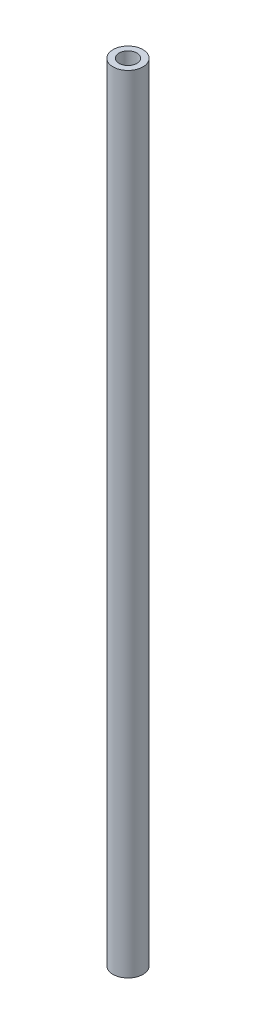
ISO-10303-21;
HEADER;
FILE_DESCRIPTION(('STEP AP214'),'2;1');
FILE_NAME('part.step','',(''),(''),'','','');
FILE_SCHEMA(('AUTOMOTIVE_DESIGN { 1 0 10303 214 1 1 1 1 }'));
ENDSEC;
DATA;
#1=APPLICATION_CONTEXT('core data for automotive mechanical design processes');
#2=APPLICATION_PROTOCOL_DEFINITION('international standard','automotive_design',2000,#1);
#3=PRODUCT_CONTEXT('',#1,'mechanical');
#4=PRODUCT('Part','Part','',(#3));
#5=PRODUCT_RELATED_PRODUCT_CATEGORY('part','',(#4));
#6=PRODUCT_DEFINITION_FORMATION('','',#4);
#7=PRODUCT_DEFINITION_CONTEXT('part definition',#1,'design');
#8=PRODUCT_DEFINITION('design','',#6,#7);
#9=PRODUCT_DEFINITION_SHAPE('','',#8);
#10=(LENGTH_UNIT() NAMED_UNIT(*) SI_UNIT(.MILLI.,.METRE.));
#11=(NAMED_UNIT(*) PLANE_ANGLE_UNIT() SI_UNIT($,.RADIAN.));
#12=(NAMED_UNIT(*) SI_UNIT($,.STERADIAN.) SOLID_ANGLE_UNIT());
#13=UNCERTAINTY_MEASURE_WITH_UNIT(LENGTH_MEASURE(1.E-05),#10,'distance_accuracy_value','');
#14=(GEOMETRIC_REPRESENTATION_CONTEXT(3) GLOBAL_UNCERTAINTY_ASSIGNED_CONTEXT((#13)) GLOBAL_UNIT_ASSIGNED_CONTEXT((#10,
#11,#12)) REPRESENTATION_CONTEXT('',''));
#15=CARTESIAN_POINT('',(0.,0.,0.));
#16=DIRECTION('',(0.,0.,1.));
#17=DIRECTION('',(1.,0.,0.));
#18=AXIS2_PLACEMENT_3D('',#15,#16,#17);
#19=CARTESIAN_POINT('',(0.,105.,0.));
#20=DIRECTION('',(0.,1.,0.));
#21=DIRECTION('',(0.,0.,1.));
#22=AXIS2_PLACEMENT_3D('',#19,#20,#21);
#23=PLANE('',#22);
#24=CARTESIAN_POINT('',(0.,105.,0.));
#25=DIRECTION('',(0.,1.,0.));
#26=DIRECTION('',(0.,0.,1.));
#27=AXIS2_PLACEMENT_3D('',#24,#25,#26);
#28=CIRCLE('',#27,2.);
#29=CARTESIAN_POINT('',(0.,105.,2.));
#30=VERTEX_POINT('',#29);
#31=EDGE_CURVE('E10',#30,#30,#28,.T.);
#32=ORIENTED_EDGE('',*,*,#31,.T.);
#33=EDGE_LOOP('',(#32));
#34=FACE_BOUND('',#33,.T.);
#35=CARTESIAN_POINT('',(0.,105.,0.));
#36=DIRECTION('',(0.,1.,0.));
#37=DIRECTION('',(0.,0.,1.));
#38=AXIS2_PLACEMENT_3D('',#35,#36,#37);
#39=CIRCLE('',#38,1.2);
#40=CARTESIAN_POINT('',(0.,105.,1.2));
#41=VERTEX_POINT('',#40);
#42=EDGE_CURVE('E42',#41,#41,#39,.T.);
#43=ORIENTED_EDGE('',*,*,#42,.F.);
#44=EDGE_LOOP('',(#43));
#45=FACE_BOUND('',#44,.T.);
#46=ADVANCED_FACE('F31',(#34,#45),#23,.T.);
#47=CARTESIAN_POINT('',(0.,0.,0.));
#48=DIRECTION('',(0.,1.,0.));
#49=DIRECTION('',(0.,0.,1.));
#50=AXIS2_PLACEMENT_3D('',#47,#48,#49);
#51=PLANE('',#50);
#52=CARTESIAN_POINT('',(0.,0.,0.));
#53=DIRECTION('',(0.,1.,0.));
#54=DIRECTION('',(0.,0.,1.));
#55=AXIS2_PLACEMENT_3D('',#52,#53,#54);
#56=CIRCLE('',#55,2.);
#57=CARTESIAN_POINT('',(0.,0.,2.));
#58=VERTEX_POINT('',#57);
#59=EDGE_CURVE('E35',#58,#58,#56,.T.);
#60=ORIENTED_EDGE('',*,*,#59,.F.);
#61=EDGE_LOOP('',(#60));
#62=FACE_BOUND('',#61,.T.);
#63=CARTESIAN_POINT('',(0.,0.,0.));
#64=DIRECTION('',(0.,1.,0.));
#65=DIRECTION('',(0.,0.,1.));
#66=AXIS2_PLACEMENT_3D('',#63,#64,#65);
#67=CIRCLE('',#66,1.2);
#68=CARTESIAN_POINT('',(0.,0.,1.2));
#69=VERTEX_POINT('',#68);
#70=EDGE_CURVE('E44',#69,#69,#67,.T.);
#71=ORIENTED_EDGE('',*,*,#70,.T.);
#72=EDGE_LOOP('',(#71));
#73=FACE_BOUND('',#72,.T.);
#74=ADVANCED_FACE('F54',(#62,#73),#51,.F.);
#75=CARTESIAN_POINT('',(0.,105.,0.));
#76=DIRECTION('',(0.,-1.,0.));
#77=DIRECTION('',(0.,0.,-1.));
#78=AXIS2_PLACEMENT_3D('',#75,#76,#77);
#79=CYLINDRICAL_SURFACE('',#78,2.);
#80=ORIENTED_EDGE('',*,*,#31,.F.);
#81=EDGE_LOOP('',(#80));
#82=FACE_BOUND('',#81,.T.);
#83=ORIENTED_EDGE('',*,*,#59,.T.);
#84=EDGE_LOOP('',(#83));
#85=FACE_BOUND('',#84,.T.);
#86=ADVANCED_FACE('F33',(#82,#85),#79,.T.);
#87=CARTESIAN_POINT('',(0.,105.,0.));
#88=DIRECTION('',(0.,-1.,0.));
#89=DIRECTION('',(0.,0.,-1.));
#90=AXIS2_PLACEMENT_3D('',#87,#88,#89);
#91=CYLINDRICAL_SURFACE('',#90,1.2);
#92=ORIENTED_EDGE('',*,*,#42,.T.);
#93=EDGE_LOOP('',(#92));
#94=FACE_BOUND('',#93,.T.);
#95=ORIENTED_EDGE('',*,*,#70,.F.);
#96=EDGE_LOOP('',(#95));
#97=FACE_BOUND('',#96,.T.);
#98=ADVANCED_FACE('F50',(#94,#97),#91,.F.);
#99=CLOSED_SHELL('',(#46,#74,#86,#98));
#100=MANIFOLD_SOLID_BREP('B2',#99);
#101=ADVANCED_BREP_SHAPE_REPRESENTATION('',(#18,#100),#14);
#102=SHAPE_DEFINITION_REPRESENTATION(#9,#101);
ENDSEC;
END-ISO-10303-21;
